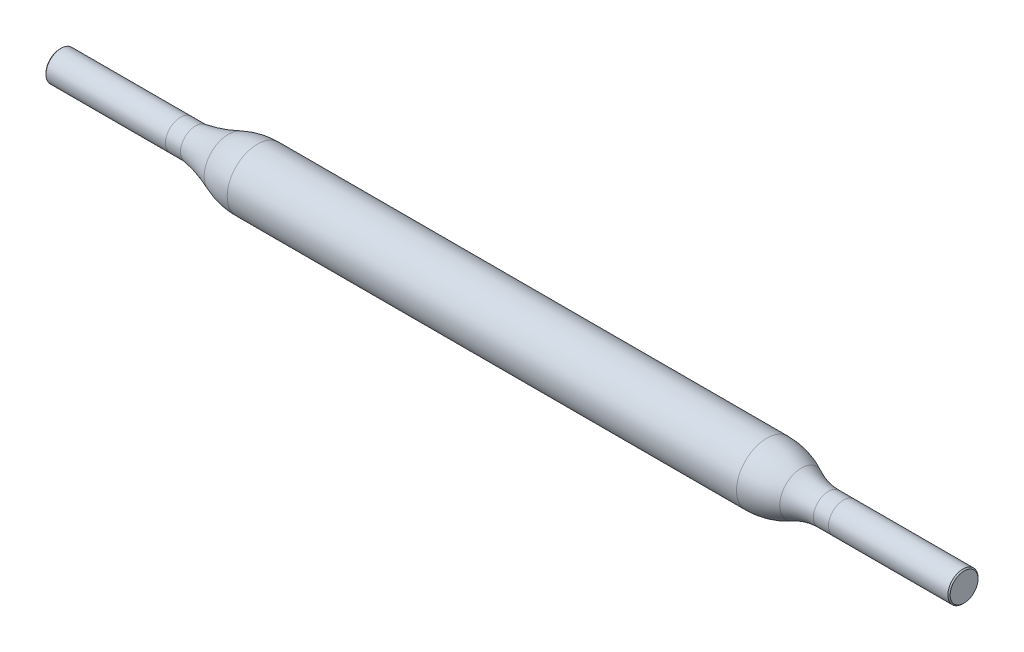
ISO-10303-21;
HEADER;
FILE_DESCRIPTION(('STEP AP214'),'2;1');
FILE_NAME('part.step','',(''),(''),'','','');
FILE_SCHEMA(('AUTOMOTIVE_DESIGN { 1 0 10303 214 1 1 1 1 }'));
ENDSEC;
DATA;
#1=APPLICATION_CONTEXT('core data for automotive mechanical design processes');
#2=APPLICATION_PROTOCOL_DEFINITION('international standard','automotive_design',2000,#1);
#3=PRODUCT_CONTEXT('',#1,'mechanical');
#4=PRODUCT('Part','Part','',(#3));
#5=PRODUCT_RELATED_PRODUCT_CATEGORY('part','',(#4));
#6=PRODUCT_DEFINITION_FORMATION('','',#4);
#7=PRODUCT_DEFINITION_CONTEXT('part definition',#1,'design');
#8=PRODUCT_DEFINITION('design','',#6,#7);
#9=PRODUCT_DEFINITION_SHAPE('','',#8);
#10=(LENGTH_UNIT() NAMED_UNIT(*) SI_UNIT(.MILLI.,.METRE.));
#11=(NAMED_UNIT(*) PLANE_ANGLE_UNIT() SI_UNIT($,.RADIAN.));
#12=(NAMED_UNIT(*) SI_UNIT($,.STERADIAN.) SOLID_ANGLE_UNIT());
#13=UNCERTAINTY_MEASURE_WITH_UNIT(LENGTH_MEASURE(1.E-05),#10,'distance_accuracy_value','');
#14=(GEOMETRIC_REPRESENTATION_CONTEXT(3) GLOBAL_UNCERTAINTY_ASSIGNED_CONTEXT((#13)) GLOBAL_UNIT_ASSIGNED_CONTEXT((#10,
#11,#12)) REPRESENTATION_CONTEXT('',''));
#15=CARTESIAN_POINT('',(0.,0.,0.));
#16=DIRECTION('',(0.,0.,1.));
#17=DIRECTION('',(1.,0.,0.));
#18=AXIS2_PLACEMENT_3D('',#15,#16,#17);
#19=CARTESIAN_POINT('',(-30.,0.,0.));
#20=DIRECTION('',(-1.,0.,0.));
#21=DIRECTION('',(0.,0.,1.));
#22=AXIS2_PLACEMENT_3D('',#19,#20,#21);
#23=CYLINDRICAL_SURFACE('',#22,1.);
#24=CARTESIAN_POINT('',(21.,0.,0.));
#25=DIRECTION('',(-1.,0.,0.));
#26=DIRECTION('',(0.,0.,1.));
#27=AXIS2_PLACEMENT_3D('',#24,#25,#26);
#28=CIRCLE('',#27,0.999999999999999);
#29=CARTESIAN_POINT('',(21.,0.,0.999999999999999));
#30=VERTEX_POINT('',#29);
#31=EDGE_CURVE('E73',#30,#30,#28,.T.);
#32=ORIENTED_EDGE('',*,*,#31,.F.);
#33=EDGE_LOOP('',(#32));
#34=FACE_BOUND('',#33,.T.);
#35=CARTESIAN_POINT('',(22.,0.,0.));
#36=DIRECTION('',(1.,0.,0.));
#37=DIRECTION('',(0.,1.,0.));
#38=AXIS2_PLACEMENT_3D('',#35,#36,#37);
#39=CIRCLE('',#38,1.);
#40=CARTESIAN_POINT('',(22.,1.,0.));
#41=VERTEX_POINT('',#40);
#42=EDGE_CURVE('E65',#41,#41,#39,.T.);
#43=ORIENTED_EDGE('',*,*,#42,.F.);
#44=EDGE_LOOP('',(#43));
#45=FACE_BOUND('',#44,.T.);
#46=ADVANCED_FACE('F44',(#34,#45),#23,.T.);
#47=CARTESIAN_POINT('',(-30.,0.,0.));
#48=DIRECTION('',(-1.,0.,0.));
#49=DIRECTION('',(0.,0.,1.));
#50=AXIS2_PLACEMENT_3D('',#47,#48,#49);
#51=CYLINDRICAL_SURFACE('',#50,1.);
#52=CARTESIAN_POINT('',(-29.925,0.,0.));
#53=DIRECTION('',(1.,0.,0.));
#54=DIRECTION('',(0.,0.,-1.));
#55=AXIS2_PLACEMENT_3D('',#52,#53,#54);
#56=CIRCLE('',#55,1.);
#57=CARTESIAN_POINT('',(-29.925,0.,-1.));
#58=VERTEX_POINT('',#57);
#59=EDGE_CURVE('E10',#58,#58,#56,.T.);
#60=ORIENTED_EDGE('',*,*,#59,.T.);
#61=EDGE_LOOP('',(#60));
#62=FACE_BOUND('',#61,.T.);
#63=CARTESIAN_POINT('',(-22.,0.,0.));
#64=DIRECTION('',(1.,0.,0.));
#65=DIRECTION('',(0.,1.,0.));
#66=AXIS2_PLACEMENT_3D('',#63,#64,#65);
#67=CIRCLE('',#66,1.);
#68=CARTESIAN_POINT('',(-22.,1.,0.));
#69=VERTEX_POINT('',#68);
#70=EDGE_CURVE('E69',#69,#69,#67,.T.);
#71=ORIENTED_EDGE('',*,*,#70,.F.);
#72=EDGE_LOOP('',(#71));
#73=FACE_BOUND('',#72,.T.);
#74=ADVANCED_FACE('F127',(#62,#73),#51,.T.);
#75=CARTESIAN_POINT('',(-30.,0.,0.));
#76=DIRECTION('',(1.,0.,0.));
#77=DIRECTION('',(0.,0.,-1.));
#78=AXIS2_PLACEMENT_3D('',#75,#76,#77);
#79=PLANE('',#78);
#80=CARTESIAN_POINT('',(-30.,0.,0.));
#81=DIRECTION('',(1.,0.,0.));
#82=DIRECTION('',(0.,0.,-1.));
#83=AXIS2_PLACEMENT_3D('',#80,#81,#82);
#84=CIRCLE('',#83,0.924999999999995);
#85=CARTESIAN_POINT('',(-30.,0.,-0.924999999999995));
#86=VERTEX_POINT('',#85);
#87=EDGE_CURVE('E52',#86,#86,#84,.F.);
#88=ORIENTED_EDGE('',*,*,#87,.T.);
#89=EDGE_LOOP('',(#88));
#90=FACE_BOUND('',#89,.T.);
#91=ADVANCED_FACE('F137',(#90),#79,.F.);
#92=CARTESIAN_POINT('',(30.,0.,0.));
#93=DIRECTION('',(-1.,0.,0.));
#94=DIRECTION('',(0.,0.,1.));
#95=AXIS2_PLACEMENT_3D('',#92,#93,#94);
#96=PLANE('',#95);
#97=CARTESIAN_POINT('',(30.,0.,0.));
#98=DIRECTION('',(-1.,0.,0.));
#99=DIRECTION('',(0.,0.,1.));
#100=AXIS2_PLACEMENT_3D('',#97,#98,#99);
#101=CIRCLE('',#100,0.925000000000002);
#102=CARTESIAN_POINT('',(30.,0.,0.925000000000002));
#103=VERTEX_POINT('',#102);
#104=EDGE_CURVE('E56',#103,#103,#101,.F.);
#105=ORIENTED_EDGE('',*,*,#104,.T.);
#106=EDGE_LOOP('',(#105));
#107=FACE_BOUND('',#106,.T.);
#108=ADVANCED_FACE('F132',(#107),#96,.F.);
#109=CARTESIAN_POINT('',(29.925,0.,0.));
#110=DIRECTION('',(-1.,0.,0.));
#111=DIRECTION('',(0.,0.,1.));
#112=AXIS2_PLACEMENT_3D('',#109,#110,#111);
#113=CIRCLE('',#112,1.);
#114=CARTESIAN_POINT('',(29.925,0.,1.));
#115=VERTEX_POINT('',#114);
#116=EDGE_CURVE('E60',#115,#115,#113,.T.);
#117=ORIENTED_EDGE('',*,*,#116,.T.);
#118=EDGE_LOOP('',(#117));
#119=FACE_BOUND('',#118,.T.);
#120=ORIENTED_EDGE('',*,*,#42,.T.);
#121=EDGE_LOOP('',(#120));
#122=FACE_BOUND('',#121,.T.);
#123=ADVANCED_FACE('F121',(#119,#122),#23,.T.);
#124=CARTESIAN_POINT('',(21.,0.,0.));
#125=DIRECTION('',(-1.,0.,0.));
#126=DIRECTION('',(0.,0.,1.));
#127=AXIS2_PLACEMENT_3D('',#124,#125,#126);
#128=TOROIDAL_SURFACE('',#127,4.90482037595371,3.90482037595372);
#129=CARTESIAN_POINT('',(19.2021431324268,0.,0.));
#130=DIRECTION('',(-1.,0.,0.));
#131=DIRECTION('',(0.,0.,1.));
#132=AXIS2_PLACEMENT_3D('',#129,#130,#131);
#133=CIRCLE('',#132,1.43850636072325);
#134=CARTESIAN_POINT('',(19.2021431324268,0.,1.43850636072325));
#135=VERTEX_POINT('',#134);
#136=EDGE_CURVE('E76',#135,#135,#133,.T.);
#137=ORIENTED_EDGE('',*,*,#136,.F.);
#138=EDGE_LOOP('',(#137));
#139=FACE_BOUND('',#138,.T.);
#140=ORIENTED_EDGE('',*,*,#31,.T.);
#141=EDGE_LOOP('',(#140));
#142=FACE_BOUND('',#141,.T.);
#143=ADVANCED_FACE('F115',(#139,#142),#128,.F.);
#144=CARTESIAN_POINT('',(16.9000438109771,0.,0.));
#145=DIRECTION('',(-1.,0.,0.));
#146=DIRECTION('',(0.,0.,1.));
#147=AXIS2_PLACEMENT_3D('',#144,#145,#146);
#148=DEGENERATE_TOROIDAL_SURFACE('',#147,3.,5.,.F.);
#149=CARTESIAN_POINT('',(16.9000438109771,0.,0.));
#150=DIRECTION('',(-1.,0.,0.));
#151=DIRECTION('',(0.,0.,1.));
#152=AXIS2_PLACEMENT_3D('',#149,#150,#151);
#153=CIRCLE('',#152,2.);
#154=CARTESIAN_POINT('',(16.9000438109771,0.,2.));
#155=VERTEX_POINT('',#154);
#156=EDGE_CURVE('E79',#155,#155,#153,.T.);
#157=ORIENTED_EDGE('',*,*,#156,.F.);
#158=EDGE_LOOP('',(#157));
#159=FACE_BOUND('',#158,.T.);
#160=ORIENTED_EDGE('',*,*,#136,.T.);
#161=EDGE_LOOP('',(#160));
#162=FACE_BOUND('',#161,.T.);
#163=ADVANCED_FACE('F109',(#159,#162),#148,.F.);
#164=CARTESIAN_POINT('',(-30.,0.,0.));
#165=DIRECTION('',(-1.,0.,0.));
#166=DIRECTION('',(0.,0.,1.));
#167=AXIS2_PLACEMENT_3D('',#164,#165,#166);
#168=CYLINDRICAL_SURFACE('',#167,2.);
#169=CARTESIAN_POINT('',(-16.9000438109771,0.,0.));
#170=DIRECTION('',(-1.,0.,0.));
#171=DIRECTION('',(0.,0.,1.));
#172=AXIS2_PLACEMENT_3D('',#169,#170,#171);
#173=CIRCLE('',#172,2.);
#174=CARTESIAN_POINT('',(-16.9000438109771,0.,2.));
#175=VERTEX_POINT('',#174);
#176=EDGE_CURVE('E82',#175,#175,#173,.T.);
#177=ORIENTED_EDGE('',*,*,#176,.F.);
#178=EDGE_LOOP('',(#177));
#179=FACE_BOUND('',#178,.T.);
#180=ORIENTED_EDGE('',*,*,#156,.T.);
#181=EDGE_LOOP('',(#180));
#182=FACE_BOUND('',#181,.T.);
#183=ADVANCED_FACE('F103',(#179,#182),#168,.T.);
#184=CARTESIAN_POINT('',(-16.9000438109771,0.,0.));
#185=DIRECTION('',(-1.,0.,0.));
#186=DIRECTION('',(0.,0.,1.));
#187=AXIS2_PLACEMENT_3D('',#184,#185,#186);
#188=DEGENERATE_TOROIDAL_SURFACE('',#187,3.,5.,.F.);
#189=CARTESIAN_POINT('',(-18.8110677209233,0.,0.));
#190=DIRECTION('',(-1.,0.,0.));
#191=DIRECTION('',(0.,0.,1.));
#192=AXIS2_PLACEMENT_3D('',#189,#190,#191);
#193=CIRCLE('',#192,1.62038825377413);
#194=CARTESIAN_POINT('',(-18.8110677209233,0.,1.62038825377413));
#195=VERTEX_POINT('',#194);
#196=EDGE_CURVE('E85',#195,#195,#193,.T.);
#197=ORIENTED_EDGE('',*,*,#196,.F.);
#198=EDGE_LOOP('',(#197));
#199=FACE_BOUND('',#198,.T.);
#200=ORIENTED_EDGE('',*,*,#176,.T.);
#201=EDGE_LOOP('',(#200));
#202=FACE_BOUND('',#201,.T.);
#203=ADVANCED_FACE('F97',(#199,#202),#188,.F.);
#204=CARTESIAN_POINT('',(-22.5675385361195,0.,0.));
#205=DIRECTION('',(-1.,0.,0.));
#206=DIRECTION('',(0.,0.,1.));
#207=AXIS2_PLACEMENT_3D('',#204,#205,#206);
#208=TOROIDAL_SURFACE('',#207,10.7026156083585,9.82842442641659);
#209=CARTESIAN_POINT('',(-21.,0.,0.));
#210=DIRECTION('',(-1.,0.,0.));
#211=DIRECTION('',(0.,0.,1.));
#212=AXIS2_PLACEMENT_3D('',#209,#210,#211);
#213=CIRCLE('',#212,0.999999999999999);
#214=CARTESIAN_POINT('',(-21.,0.,0.999999999999999));
#215=VERTEX_POINT('',#214);
#216=EDGE_CURVE('E88',#215,#215,#213,.T.);
#217=ORIENTED_EDGE('',*,*,#216,.F.);
#218=EDGE_LOOP('',(#217));
#219=FACE_BOUND('',#218,.T.);
#220=ORIENTED_EDGE('',*,*,#196,.T.);
#221=EDGE_LOOP('',(#220));
#222=FACE_BOUND('',#221,.T.);
#223=ADVANCED_FACE('F94',(#219,#222),#208,.F.);
#224=ORIENTED_EDGE('',*,*,#70,.T.);
#225=EDGE_LOOP('',(#224));
#226=FACE_BOUND('',#225,.T.);
#227=ORIENTED_EDGE('',*,*,#216,.T.);
#228=EDGE_LOOP('',(#227));
#229=FACE_BOUND('',#228,.T.);
#230=ADVANCED_FACE('F92',(#226,#229),#51,.T.);
#231=CARTESIAN_POINT('',(29.925,0.,0.));
#232=DIRECTION('',(-1.,0.,0.));
#233=DIRECTION('',(0.,0.,1.));
#234=AXIS2_PLACEMENT_3D('',#231,#232,#233);
#235=CONICAL_SURFACE('',#234,1.,0.785398163397486);
#236=ORIENTED_EDGE('',*,*,#104,.F.);
#237=EDGE_LOOP('',(#236));
#238=FACE_BOUND('',#237,.T.);
#239=ORIENTED_EDGE('',*,*,#116,.F.);
#240=EDGE_LOOP('',(#239));
#241=FACE_BOUND('',#240,.T.);
#242=ADVANCED_FACE('F143',(#238,#241),#235,.T.);
#243=CARTESIAN_POINT('',(-30.,0.,0.));
#244=DIRECTION('',(1.,0.,0.));
#245=DIRECTION('',(0.,0.,-1.));
#246=AXIS2_PLACEMENT_3D('',#243,#244,#245);
#247=CONICAL_SURFACE('',#246,0.924999999999995,0.785398163397486);
#248=ORIENTED_EDGE('',*,*,#59,.F.);
#249=EDGE_LOOP('',(#248));
#250=FACE_BOUND('',#249,.T.);
#251=ORIENTED_EDGE('',*,*,#87,.F.);
#252=EDGE_LOOP('',(#251));
#253=FACE_BOUND('',#252,.T.);
#254=ADVANCED_FACE('F47',(#250,#253),#247,.T.);
#255=CLOSED_SHELL('',(#46,#74,#91,#108,#123,#143,#163,#183,#203,#223,#230,#242,#254));
#256=MANIFOLD_SOLID_BREP('B2',#255);
#257=ADVANCED_BREP_SHAPE_REPRESENTATION('',(#18,#256),#14);
#258=SHAPE_DEFINITION_REPRESENTATION(#9,#257);
ENDSEC;
END-ISO-10303-21;
